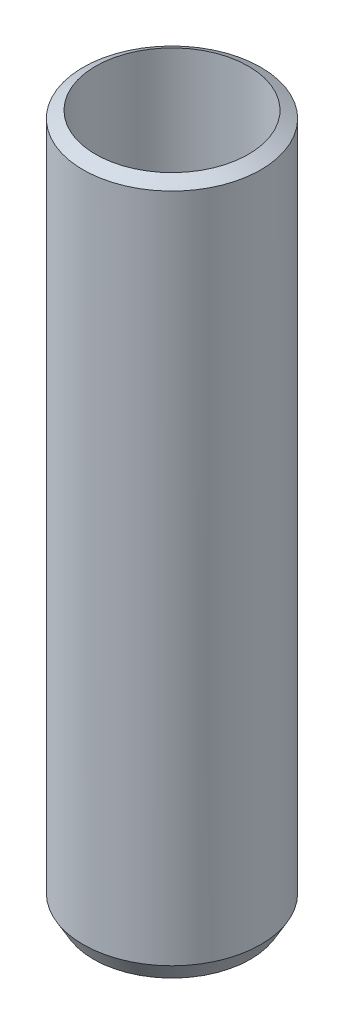
ISO-10303-21;
HEADER;
FILE_DESCRIPTION(('STEP AP214'),'2;1');
FILE_NAME('part.step','',(''),(''),'','','');
FILE_SCHEMA(('AUTOMOTIVE_DESIGN { 1 0 10303 214 1 1 1 1 }'));
ENDSEC;
DATA;
#1=APPLICATION_CONTEXT('core data for automotive mechanical design processes');
#2=APPLICATION_PROTOCOL_DEFINITION('international standard','automotive_design',2000,#1);
#3=PRODUCT_CONTEXT('',#1,'mechanical');
#4=PRODUCT('Part','Part','',(#3));
#5=PRODUCT_RELATED_PRODUCT_CATEGORY('part','',(#4));
#6=PRODUCT_DEFINITION_FORMATION('','',#4);
#7=PRODUCT_DEFINITION_CONTEXT('part definition',#1,'design');
#8=PRODUCT_DEFINITION('design','',#6,#7);
#9=PRODUCT_DEFINITION_SHAPE('','',#8);
#10=(LENGTH_UNIT() NAMED_UNIT(*) SI_UNIT(.MILLI.,.METRE.));
#11=(NAMED_UNIT(*) PLANE_ANGLE_UNIT() SI_UNIT($,.RADIAN.));
#12=(NAMED_UNIT(*) SI_UNIT($,.STERADIAN.) SOLID_ANGLE_UNIT());
#13=UNCERTAINTY_MEASURE_WITH_UNIT(LENGTH_MEASURE(1.E-05),#10,'distance_accuracy_value','');
#14=(GEOMETRIC_REPRESENTATION_CONTEXT(3) GLOBAL_UNCERTAINTY_ASSIGNED_CONTEXT((#13)) GLOBAL_UNIT_ASSIGNED_CONTEXT((#10,
#11,#12)) REPRESENTATION_CONTEXT('',''));
#15=CARTESIAN_POINT('',(0.,0.,0.));
#16=DIRECTION('',(0.,0.,1.));
#17=DIRECTION('',(1.,0.,0.));
#18=AXIS2_PLACEMENT_3D('',#15,#16,#17);
#19=CARTESIAN_POINT('',(0.,393.464890454647,0.));
#20=DIRECTION('',(0.,-1.,0.));
#21=DIRECTION('',(0.,0.,-1.));
#22=AXIS2_PLACEMENT_3D('',#19,#20,#21);
#23=CYLINDRICAL_SURFACE('',#22,50.);
#24=CARTESIAN_POINT('',(0.,387.618646580888,0.));
#25=DIRECTION('',(0.,1.,0.));
#26=DIRECTION('',(0.,0.,1.));
#27=AXIS2_PLACEMENT_3D('',#24,#25,#26);
#28=CIRCLE('',#27,50.);
#29=CARTESIAN_POINT('',(0.,387.618646580888,-50.));
#30=VERTEX_POINT('',#29);
#31=EDGE_CURVE('E50',#30,#30,#28,.F.);
#32=CARTESIAN_POINT('',(0.,10.1259914227904,0.));
#33=DIRECTION('',(0.,1.,0.));
#34=DIRECTION('',(0.,0.,1.));
#35=AXIS2_PLACEMENT_3D('',#32,#33,#34);
#36=CIRCLE('',#35,50.);
#37=CARTESIAN_POINT('',(0.,10.1259914227904,-50.));
#38=VERTEX_POINT('',#37);
#39=EDGE_CURVE('E51',#38,#38,#36,.T.);
#40=CARTESIAN_POINT('',(0.,387.618646580888,-50.));
#41=CARTESIAN_POINT('',(0.,383.686431422991,-50.));
#42=CARTESIAN_POINT('',(0.,379.754216265094,-50.));
#43=CARTESIAN_POINT('',(0.,371.889785949301,-50.));
#44=CARTESIAN_POINT('',(0.,367.957570791404,-50.));
#45=CARTESIAN_POINT('',(0.,360.09314047561,-50.));
#46=CARTESIAN_POINT('',(0.,356.160925317713,-50.));
#47=CARTESIAN_POINT('',(0.,348.296495001919,-50.));
#48=CARTESIAN_POINT('',(0.,344.364279844023,-50.));
#49=CARTESIAN_POINT('',(0.,336.499849528229,-50.));
#50=CARTESIAN_POINT('',(0.,332.567634370332,-50.));
#51=CARTESIAN_POINT('',(0.,324.703204054538,-50.));
#52=CARTESIAN_POINT('',(0.,320.770988896641,-50.));
#53=CARTESIAN_POINT('',(0.,312.906558580848,-50.));
#54=CARTESIAN_POINT('',(0.,308.974343422951,-50.));
#55=CARTESIAN_POINT('',(0.,301.109913107157,-50.));
#56=CARTESIAN_POINT('',(0.,297.17769794926,-50.));
#57=CARTESIAN_POINT('',(0.,289.313267633467,-50.));
#58=CARTESIAN_POINT('',(0.,285.38105247557,-50.));
#59=CARTESIAN_POINT('',(0.,277.516622159776,-50.));
#60=CARTESIAN_POINT('',(0.,273.584407001879,-50.));
#61=CARTESIAN_POINT('',(0.,265.719976686086,-50.));
#62=CARTESIAN_POINT('',(0.,261.787761528189,-50.));
#63=CARTESIAN_POINT('',(0.,253.923331212395,-50.));
#64=CARTESIAN_POINT('',(0.,249.991116054498,-50.));
#65=CARTESIAN_POINT('',(0.,242.126685738704,-50.));
#66=CARTESIAN_POINT('',(0.,238.194470580808,-50.));
#67=CARTESIAN_POINT('',(0.,230.330040265014,-50.));
#68=CARTESIAN_POINT('',(0.,226.397825107117,-50.));
#69=CARTESIAN_POINT('',(0.,218.533394791323,-50.));
#70=CARTESIAN_POINT('',(0.,214.601179633427,-50.));
#71=CARTESIAN_POINT('',(0.,206.736749317633,-50.));
#72=CARTESIAN_POINT('',(0.,202.804534159736,-50.));
#73=CARTESIAN_POINT('',(0.,194.940103843942,-50.));
#74=CARTESIAN_POINT('',(0.,191.007888686045,-50.));
#75=CARTESIAN_POINT('',(0.,183.143458370252,-50.));
#76=CARTESIAN_POINT('',(0.,179.211243212355,-50.));
#77=CARTESIAN_POINT('',(0.,171.346812896561,-50.));
#78=CARTESIAN_POINT('',(0.,167.414597738664,-50.));
#79=CARTESIAN_POINT('',(0.,159.550167422871,-50.));
#80=CARTESIAN_POINT('',(0.,155.617952264974,-50.));
#81=CARTESIAN_POINT('',(0.,147.75352194918,-50.));
#82=CARTESIAN_POINT('',(0.,143.821306791283,-50.));
#83=CARTESIAN_POINT('',(0.,135.95687647549,-50.));
#84=CARTESIAN_POINT('',(0.,132.024661317593,-50.));
#85=CARTESIAN_POINT('',(0.,124.160231001799,-50.));
#86=CARTESIAN_POINT('',(0.,120.228015843902,-50.));
#87=CARTESIAN_POINT('',(0.,112.363585528108,-50.));
#88=CARTESIAN_POINT('',(0.,108.431370370212,-50.));
#89=CARTESIAN_POINT('',(0.,100.566940054418,-50.));
#90=CARTESIAN_POINT('',(0.,96.634724896521,-50.));
#91=CARTESIAN_POINT('',(0.,88.7702945807273,-50.));
#92=CARTESIAN_POINT('',(0.,84.8380794228305,-50.));
#93=CARTESIAN_POINT('',(0.,76.9736491070368,-50.));
#94=CARTESIAN_POINT('',(0.,73.0414339491399,-50.));
#95=CARTESIAN_POINT('',(0.,65.1770036333463,-50.));
#96=CARTESIAN_POINT('',(0.,61.2447884754494,-50.));
#97=CARTESIAN_POINT('',(0.,53.3803581596557,-50.));
#98=CARTESIAN_POINT('',(0.,49.4481430017588,-50.));
#99=CARTESIAN_POINT('',(0.,41.5837126859651,-50.));
#100=CARTESIAN_POINT('',(0.,37.6514975280683,-50.));
#101=CARTESIAN_POINT('',(0.,29.7870672122746,-50.));
#102=CARTESIAN_POINT('',(0.,25.8548520543777,-50.));
#103=CARTESIAN_POINT('',(0.,17.990421738584,-50.));
#104=CARTESIAN_POINT('',(0.,14.0582065806872,-50.));
#105=CARTESIAN_POINT('',(0.,10.1259914227904,-50.));
#106=B_SPLINE_CURVE_WITH_KNOTS('',3,(#40,#41,#42,#43,#44,#45,#46,#47,#48,#49,#50,#51,#52,#53,
#54,#55,#56,#57,#58,#59,#60,#61,#62,#63,#64,#65,#66,#67,#68,#69,#70,#71,#72,#73,#74,#75,#76,#77,
#78,#79,#80,#81,#82,#83,#84,#85,#86,#87,#88,#89,#90,#91,#92,#93,#94,#95,#96,#97,#98,#99,#100,
#101,#102,#103,#104,#105),.UNSPECIFIED.,.F.,.F.,(4,2,2,2,2,2,2,2,2,2,2,2,2,2,2,2,2,2,2,2,2,2,2,
2,2,2,2,2,2,2,2,2,4),(0.,11.7966454736906,23.5932909473811,35.3899364210717,47.1865818947622,
58.9832273684528,70.7798728421433,82.5765183158339,94.3731637895244,106.169809263215,
117.966454736906,129.763100210596,141.559745684287,153.356391157977,165.153036631668,
176.949682105358,188.746327579049,200.542973052739,212.33961852643,224.13626400012,
235.932909473811,247.729554947502,259.526200421192,271.322845894883,283.119491368573,
294.916136842264,306.712782315954,318.509427789645,330.306073263335,342.102718737026,
353.899364210716,365.696009684407,377.492655158098),.UNSPECIFIED.);
#107=EDGE_CURVE('BSEAM39',#30,#38,#106,.T.);
#108=ORIENTED_EDGE('',*,*,#31,.T.);
#109=ORIENTED_EDGE('',*,*,#39,.T.);
#110=ORIENTED_EDGE('',*,*,#107,.T.);
#111=ORIENTED_EDGE('',*,*,#107,.F.);
#112=EDGE_LOOP('',(#108,#110,#109,#111));
#113=FACE_BOUND('',#112,.T.);
#114=ADVANCED_FACE('F39',(#113),#23,.T.);
#115=CARTESIAN_POINT('',(0.,0.,0.));
#116=DIRECTION('',(0.,1.,0.));
#117=DIRECTION('',(0.,0.,1.));
#118=AXIS2_PLACEMENT_3D('',#115,#116,#117);
#119=PLANE('',#118);
#120=CARTESIAN_POINT('',(0.,0.,0.));
#121=DIRECTION('',(0.,1.,0.));
#122=DIRECTION('',(0.,0.,1.));
#123=AXIS2_PLACEMENT_3D('',#120,#121,#122);
#124=CIRCLE('',#123,44.1537561262401);
#125=CARTESIAN_POINT('',(0.,0.,44.1537561262401));
#126=VERTEX_POINT('',#125);
#127=EDGE_CURVE('E10',#126,#126,#124,.F.);
#128=ORIENTED_EDGE('',*,*,#127,.T.);
#129=EDGE_LOOP('',(#128));
#130=FACE_BOUND('',#129,.T.);
#131=CARTESIAN_POINT('',(0.,0.,0.));
#132=DIRECTION('',(0.,1.,0.));
#133=DIRECTION('',(0.,0.,1.));
#134=AXIS2_PLACEMENT_3D('',#131,#132,#133);
#135=CIRCLE('',#134,42.9934787957711);
#136=CARTESIAN_POINT('',(0.,0.,-42.9934787957711));
#137=VERTEX_POINT('',#136);
#138=EDGE_CURVE('E58',#137,#137,#135,.T.);
#139=ORIENTED_EDGE('',*,*,#138,.T.);
#140=EDGE_LOOP('',(#139));
#141=FACE_BOUND('',#140,.T.);
#142=ADVANCED_FACE('F62',(#130,#141),#119,.F.);
#143=CARTESIAN_POINT('',(0.,393.464890454647,0.));
#144=DIRECTION('',(0.,-1.,0.));
#145=DIRECTION('',(0.,0.,-1.));
#146=AXIS2_PLACEMENT_3D('',#143,#144,#145);
#147=CYLINDRICAL_SURFACE('',#146,42.9934787957711);
#148=CARTESIAN_POINT('',(0.,391.663863484232,0.));
#149=DIRECTION('',(0.,-1.,0.));
#150=DIRECTION('',(0.,0.,-1.));
#151=AXIS2_PLACEMENT_3D('',#148,#149,#150);
#152=CIRCLE('',#151,42.9934787957711);
#153=CARTESIAN_POINT('',(0.,391.663863484232,-42.9934787957711));
#154=VERTEX_POINT('',#153);
#155=EDGE_CURVE('E54',#154,#154,#152,.F.);
#156=CARTESIAN_POINT('',(0.,391.663863484232,-42.9934787957711));
#157=CARTESIAN_POINT('',(0.,387.584031572938,-42.9934787957711));
#158=CARTESIAN_POINT('',(0.,383.504199661644,-42.9934787957711));
#159=CARTESIAN_POINT('',(0.,375.344535839056,-42.9934787957711));
#160=CARTESIAN_POINT('',(0.,371.264703927762,-42.9934787957711));
#161=CARTESIAN_POINT('',(0.,363.105040105174,-42.9934787957711));
#162=CARTESIAN_POINT('',(0.,359.02520819388,-42.9934787957711));
#163=CARTESIAN_POINT('',(0.,350.865544371291,-42.9934787957711));
#164=CARTESIAN_POINT('',(0.,346.785712459997,-42.9934787957711));
#165=CARTESIAN_POINT('',(0.,338.626048637409,-42.9934787957711));
#166=CARTESIAN_POINT('',(0.,334.546216726115,-42.9934787957711));
#167=CARTESIAN_POINT('',(0.,326.386552903527,-42.9934787957711));
#168=CARTESIAN_POINT('',(0.,322.306720992233,-42.9934787957711));
#169=CARTESIAN_POINT('',(0.,314.147057169645,-42.9934787957711));
#170=CARTESIAN_POINT('',(0.,310.067225258351,-42.9934787957711));
#171=CARTESIAN_POINT('',(0.,301.907561435762,-42.9934787957711));
#172=CARTESIAN_POINT('',(0.,297.827729524468,-42.9934787957711));
#173=CARTESIAN_POINT('',(0.,289.66806570188,-42.9934787957711));
#174=CARTESIAN_POINT('',(0.,285.588233790586,-42.9934787957711));
#175=CARTESIAN_POINT('',(0.,277.428569967998,-42.9934787957711));
#176=CARTESIAN_POINT('',(0.,273.348738056704,-42.9934787957711));
#177=CARTESIAN_POINT('',(0.,265.189074234116,-42.9934787957711));
#178=CARTESIAN_POINT('',(0.,261.109242322822,-42.9934787957711));
#179=CARTESIAN_POINT('',(0.,252.949578500233,-42.9934787957711));
#180=CARTESIAN_POINT('',(0.,248.869746588939,-42.9934787957711));
#181=CARTESIAN_POINT('',(0.,240.710082766351,-42.9934787957711));
#182=CARTESIAN_POINT('',(0.,236.630250855057,-42.9934787957711));
#183=CARTESIAN_POINT('',(0.,228.470587032469,-42.9934787957711));
#184=CARTESIAN_POINT('',(0.,224.390755121175,-42.9934787957711));
#185=CARTESIAN_POINT('',(0.,216.231091298587,-42.9934787957711));
#186=CARTESIAN_POINT('',(0.,212.151259387292,-42.9934787957711));
#187=CARTESIAN_POINT('',(0.,203.991595564704,-42.9934787957711));
#188=CARTESIAN_POINT('',(0.,199.91176365341,-42.9934787957711));
#189=CARTESIAN_POINT('',(0.,191.752099830822,-42.9934787957711));
#190=CARTESIAN_POINT('',(0.,187.672267919528,-42.9934787957711));
#191=CARTESIAN_POINT('',(0.,179.51260409694,-42.9934787957711));
#192=CARTESIAN_POINT('',(0.,175.432772185646,-42.9934787957711));
#193=CARTESIAN_POINT('',(0.,167.273108363058,-42.9934787957711));
#194=CARTESIAN_POINT('',(0.,163.193276451763,-42.9934787957711));
#195=CARTESIAN_POINT('',(0.,155.033612629175,-42.9934787957711));
#196=CARTESIAN_POINT('',(0.,150.953780717881,-42.9934787957711));
#197=CARTESIAN_POINT('',(0.,142.794116895293,-42.9934787957711));
#198=CARTESIAN_POINT('',(0.,138.714284983999,-42.9934787957711));
#199=CARTESIAN_POINT('',(0.,130.554621161411,-42.9934787957711));
#200=CARTESIAN_POINT('',(0.,126.474789250117,-42.9934787957711));
#201=CARTESIAN_POINT('',(0.,118.315125427529,-42.9934787957711));
#202=CARTESIAN_POINT('',(0.,114.235293516234,-42.9934787957711));
#203=CARTESIAN_POINT('',(0.,106.075629693646,-42.9934787957711));
#204=CARTESIAN_POINT('',(0.,101.995797782352,-42.9934787957711));
#205=CARTESIAN_POINT('',(0.,93.836133959764,-42.9934787957711));
#206=CARTESIAN_POINT('',(0.,89.7563020484699,-42.9934787957711));
#207=CARTESIAN_POINT('',(0.,81.5966382258817,-42.9934787957711));
#208=CARTESIAN_POINT('',(0.,77.5168063145876,-42.9934787957711));
#209=CARTESIAN_POINT('',(0.,69.3571424919995,-42.9934787957711));
#210=CARTESIAN_POINT('',(0.,65.2773105807054,-42.9934787957711));
#211=CARTESIAN_POINT('',(0.,57.1176467581172,-42.9934787957711));
#212=CARTESIAN_POINT('',(0.,53.0378148468231,-42.9934787957711));
#213=CARTESIAN_POINT('',(0.,44.878151024235,-42.9934787957711));
#214=CARTESIAN_POINT('',(0.,40.7983191129409,-42.9934787957711));
#215=CARTESIAN_POINT('',(0.,32.6386552903527,-42.9934787957711));
#216=CARTESIAN_POINT('',(0.,28.5588233790586,-42.9934787957711));
#217=CARTESIAN_POINT('',(0.,20.3991595564704,-42.9934787957711));
#218=CARTESIAN_POINT('',(0.,16.3193276451764,-42.9934787957711));
#219=CARTESIAN_POINT('',(0.,8.15966382258819,-42.9934787957711));
#220=CARTESIAN_POINT('',(0.,4.07983191129409,-42.9934787957711));
#221=CARTESIAN_POINT('',(0.,0.,-42.9934787957711));
#222=B_SPLINE_CURVE_WITH_KNOTS('',3,(#156,#157,#158,#159,#160,#161,#162,#163,#164,#165,#166,
#167,#168,#169,#170,#171,#172,#173,#174,#175,#176,#177,#178,#179,#180,#181,#182,#183,#184,#185,
#186,#187,#188,#189,#190,#191,#192,#193,#194,#195,#196,#197,#198,#199,#200,#201,#202,#203,#204,
#205,#206,#207,#208,#209,#210,#211,#212,#213,#214,#215,#216,#217,#218,#219,#220,#221),
.UNSPECIFIED.,.F.,.F.,(4,2,2,2,2,2,2,2,2,2,2,2,2,2,2,2,2,2,2,2,2,2,2,2,2,2,2,2,2,2,2,2,4),(0.,
12.2394957338822,24.4789914677645,36.7184872016467,48.957982935529,61.1974786694113,
73.4369744032935,85.6764701371758,97.915965871058,110.15546160494,122.394957338823,
134.634453072705,146.873948806587,159.113444540469,171.352940274352,183.592436008234,
195.831931742116,208.071427475998,220.310923209881,232.550418943763,244.789914677645,
257.029410411527,269.26890614541,281.508401879292,293.747897613174,305.987393347056,
318.226889080939,330.466384814821,342.705880548703,354.945376282585,367.184872016468,
379.42436775035,391.663863484232),.UNSPECIFIED.);
#223=EDGE_CURVE('BSEAM68',#154,#137,#222,.T.);
#224=ORIENTED_EDGE('',*,*,#155,.T.);
#225=ORIENTED_EDGE('',*,*,#138,.F.);
#226=ORIENTED_EDGE('',*,*,#223,.T.);
#227=ORIENTED_EDGE('',*,*,#223,.F.);
#228=EDGE_LOOP('',(#224,#226,#225,#227));
#229=FACE_BOUND('',#228,.T.);
#230=ADVANCED_FACE('F68',(#229),#147,.F.);
#231=CARTESIAN_POINT('',(0.,393.464890454647,0.));
#232=DIRECTION('',(0.,-1.,0.));
#233=DIRECTION('',(0.,0.,-1.));
#234=AXIS2_PLACEMENT_3D('',#231,#232,#233);
#235=CONICAL_SURFACE('',#234,39.8740085772103,1.0471975511966);
#236=CARTESIAN_POINT('',(0.,387.618646580888,-50.));
#237=CARTESIAN_POINT('',(0.,387.660784256964,-49.9270154041227));
#238=CARTESIAN_POINT('',(0.,387.702921933041,-49.8540308082453));
#239=CARTESIAN_POINT('',(0.,387.787197285194,-49.7080616164905));
#240=CARTESIAN_POINT('',(0.,387.82933496127,-49.6350770206131));
#241=CARTESIAN_POINT('',(0.,387.913610313423,-49.4891078288583));
#242=CARTESIAN_POINT('',(0.,387.9557479895,-49.416123232981));
#243=CARTESIAN_POINT('',(0.,388.040023341653,-49.2701540412262));
#244=CARTESIAN_POINT('',(0.,388.082161017729,-49.1971694453488));
#245=CARTESIAN_POINT('',(0.,388.166436369882,-49.051200253594));
#246=CARTESIAN_POINT('',(0.,388.208574045959,-48.9782156577167));
#247=CARTESIAN_POINT('',(0.,388.292849398112,-48.8322464659619));
#248=CARTESIAN_POINT('',(0.,388.334987074189,-48.7592618700845));
#249=CARTESIAN_POINT('',(0.,388.419262426341,-48.6132926783297));
#250=CARTESIAN_POINT('',(0.,388.461400102418,-48.5403080824523));
#251=CARTESIAN_POINT('',(0.,388.545675454571,-48.3943388906976));
#252=CARTESIAN_POINT('',(0.,388.587813130647,-48.3213542948202));
#253=CARTESIAN_POINT('',(0.,388.672088482801,-48.1753851030654));
#254=CARTESIAN_POINT('',(0.,388.714226158877,-48.102400507188));
#255=CARTESIAN_POINT('',(0.,388.79850151103,-47.9564313154333));
#256=CARTESIAN_POINT('',(0.,388.840639187106,-47.8834467195559));
#257=CARTESIAN_POINT('',(0.,388.92491453926,-47.7374775278011));
#258=CARTESIAN_POINT('',(0.,388.967052215336,-47.6644929319237));
#259=CARTESIAN_POINT('',(0.,389.051327567489,-47.5185237401689));
#260=CARTESIAN_POINT('',(0.,389.093465243566,-47.4455391442916));
#261=CARTESIAN_POINT('',(0.,389.177740595719,-47.2995699525368));
#262=CARTESIAN_POINT('',(0.,389.219878271795,-47.2265853566594));
#263=CARTESIAN_POINT('',(0.,389.304153623948,-47.0806161649046));
#264=CARTESIAN_POINT('',(0.,389.346291300025,-47.0076315690272));
#265=CARTESIAN_POINT('',(0.,389.430566652178,-46.8616623772725));
#266=CARTESIAN_POINT('',(0.,389.472704328254,-46.7886777813951));
#267=CARTESIAN_POINT('',(0.,389.556979680407,-46.6427085896403));
#268=CARTESIAN_POINT('',(0.,389.599117356484,-46.5697239937629));
#269=CARTESIAN_POINT('',(0.,389.683392708637,-46.4237548020082));
#270=CARTESIAN_POINT('',(0.,389.725530384713,-46.3507702061308));
#271=CARTESIAN_POINT('',(0.,389.809805736866,-46.204801014376));
#272=CARTESIAN_POINT('',(0.,389.851943412943,-46.1318164184986));
#273=CARTESIAN_POINT('',(0.,389.936218765096,-45.9858472267438));
#274=CARTESIAN_POINT('',(0.,389.978356441172,-45.9128626308665));
#275=CARTESIAN_POINT('',(0.,390.062631793325,-45.7668934391117));
#276=CARTESIAN_POINT('',(0.,390.104769469402,-45.6939088432343));
#277=CARTESIAN_POINT('',(0.,390.189044821555,-45.5479396514795));
#278=CARTESIAN_POINT('',(0.,390.231182497631,-45.4749550556021));
#279=CARTESIAN_POINT('',(0.,390.315457849784,-45.3289858638474));
#280=CARTESIAN_POINT('',(0.,390.357595525861,-45.25600126797));
#281=CARTESIAN_POINT('',(0.,390.441870878014,-45.1100320762152));
#282=CARTESIAN_POINT('',(0.,390.48400855409,-45.0370474803378));
#283=CARTESIAN_POINT('',(0.,390.568283906243,-44.8910782885831));
#284=CARTESIAN_POINT('',(0.,390.61042158232,-44.8180936927057));
#285=CARTESIAN_POINT('',(0.,390.694696934473,-44.6721245009509));
#286=CARTESIAN_POINT('',(0.,390.736834610549,-44.5991399050735));
#287=CARTESIAN_POINT('',(0.,390.821109962702,-44.4531707133187));
#288=CARTESIAN_POINT('',(0.,390.863247638779,-44.3801861174414));
#289=CARTESIAN_POINT('',(0.,390.947522990932,-44.2342169256866));
#290=CARTESIAN_POINT('',(0.,390.989660667008,-44.1612323298092));
#291=CARTESIAN_POINT('',(0.,391.073936019161,-44.0152631380544));
#292=CARTESIAN_POINT('',(0.,391.116073695238,-43.9422785421771));
#293=CARTESIAN_POINT('',(0.,391.200349047391,-43.7963093504223));
#294=CARTESIAN_POINT('',(0.,391.242486723467,-43.7233247545449));
#295=CARTESIAN_POINT('',(0.,391.32676207562,-43.5773555627901));
#296=CARTESIAN_POINT('',(0.,391.368899751697,-43.5043709669127));
#297=CARTESIAN_POINT('',(0.,391.45317510385,-43.358401775158));
#298=CARTESIAN_POINT('',(0.,391.495312779926,-43.2854171792806));
#299=CARTESIAN_POINT('',(0.,391.579588132079,-43.1394479875258));
#300=CARTESIAN_POINT('',(0.,391.621725808156,-43.0664633916484));
#301=CARTESIAN_POINT('',(0.,391.663863484232,-42.993478795771));
#302=B_SPLINE_CURVE_WITH_KNOTS('',3,(#236,#237,#238,#239,#240,#241,#242,#243,#244,#245,#246,
#247,#248,#249,#250,#251,#252,#253,#254,#255,#256,#257,#258,#259,#260,#261,#262,#263,#264,#265,
#266,#267,#268,#269,#270,#271,#272,#273,#274,#275,#276,#277,#278,#279,#280,#281,#282,#283,#284,
#285,#286,#287,#288,#289,#290,#291,#292,#293,#294,#295,#296,#297,#298,#299,#300,#301),
.UNSPECIFIED.,.F.,.F.,(4,2,2,2,2,2,2,2,2,2,2,2,2,2,2,2,2,2,2,2,2,2,2,2,2,2,2,2,2,2,2,2,4),(0.,
0.252826056459002,0.505652112918038,0.758478169377068,1.0113042258361,1.26413028229513,
1.51695633875416,1.76978239521317,2.0226084516722,2.27543450813123,2.52826056459026,
2.78108662104929,3.03391267750832,3.28673873396733,3.53956479042636,3.79239084688539,
4.04521690334442,4.29804295980345,4.55086901626249,4.80369507272152,5.05652112918052,
5.30934718563955,5.56217324209858,5.81499929855761,6.06782535501665,6.32065141147568,
6.57347746793468,6.82630352439371,7.07912958085274,7.33195563731178,7.58478169377081,
7.83760775022984,8.09043380668887),.UNSPECIFIED.);
#303=EDGE_CURVE('BSEAM66',#30,#154,#302,.T.);
#304=ORIENTED_EDGE('',*,*,#31,.F.);
#305=ORIENTED_EDGE('',*,*,#155,.F.);
#306=ORIENTED_EDGE('',*,*,#303,.T.);
#307=ORIENTED_EDGE('',*,*,#303,.F.);
#308=EDGE_LOOP('',(#304,#306,#305,#307));
#309=FACE_BOUND('',#308,.T.);
#310=ADVANCED_FACE('F66',(#309),#235,.T.);
#311=CARTESIAN_POINT('',(0.,10.1259914227904,0.));
#312=DIRECTION('',(0.,1.,0.));
#313=DIRECTION('',(0.,0.,1.));
#314=AXIS2_PLACEMENT_3D('',#311,#312,#313);
#315=CONICAL_SURFACE('',#314,50.,0.523598775598302);
#316=ORIENTED_EDGE('',*,*,#127,.F.);
#317=EDGE_LOOP('',(#316));
#318=FACE_BOUND('',#317,.T.);
#319=ORIENTED_EDGE('',*,*,#39,.F.);
#320=EDGE_LOOP('',(#319));
#321=FACE_BOUND('',#320,.T.);
#322=ADVANCED_FACE('F45',(#318,#321),#315,.T.);
#323=CLOSED_SHELL('',(#114,#142,#230,#310,#322));
#324=MANIFOLD_SOLID_BREP('B2',#323);
#325=ADVANCED_BREP_SHAPE_REPRESENTATION('',(#18,#324),#14);
#326=SHAPE_DEFINITION_REPRESENTATION(#9,#325);
ENDSEC;
END-ISO-10303-21;
